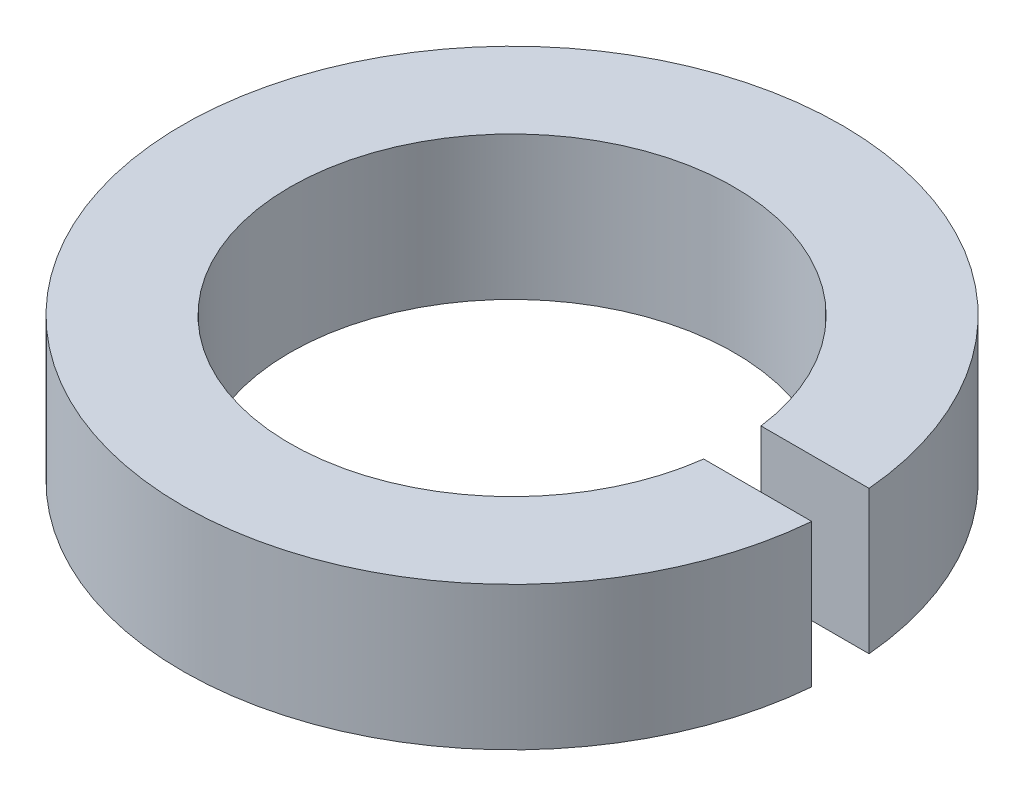
ISO-10303-21;
HEADER;
FILE_DESCRIPTION(('STEP AP214'),'2;1');
FILE_NAME('part.step','',(''),(''),'','','');
FILE_SCHEMA(('AUTOMOTIVE_DESIGN { 1 0 10303 214 1 1 1 1 }'));
ENDSEC;
DATA;
#1=APPLICATION_CONTEXT('core data for automotive mechanical design processes');
#2=APPLICATION_PROTOCOL_DEFINITION('international standard','automotive_design',2000,#1);
#3=PRODUCT_CONTEXT('',#1,'mechanical');
#4=PRODUCT('Part','Part','',(#3));
#5=PRODUCT_RELATED_PRODUCT_CATEGORY('part','',(#4));
#6=PRODUCT_DEFINITION_FORMATION('','',#4);
#7=PRODUCT_DEFINITION_CONTEXT('part definition',#1,'design');
#8=PRODUCT_DEFINITION('design','',#6,#7);
#9=PRODUCT_DEFINITION_SHAPE('','',#8);
#10=(LENGTH_UNIT() NAMED_UNIT(*) SI_UNIT(.MILLI.,.METRE.));
#11=(NAMED_UNIT(*) PLANE_ANGLE_UNIT() SI_UNIT($,.RADIAN.));
#12=(NAMED_UNIT(*) SI_UNIT($,.STERADIAN.) SOLID_ANGLE_UNIT());
#13=UNCERTAINTY_MEASURE_WITH_UNIT(LENGTH_MEASURE(1.E-05),#10,'distance_accuracy_value','');
#14=(GEOMETRIC_REPRESENTATION_CONTEXT(3) GLOBAL_UNCERTAINTY_ASSIGNED_CONTEXT((#13)) GLOBAL_UNIT_ASSIGNED_CONTEXT((#10,
#11,#12)) REPRESENTATION_CONTEXT('',''));
#15=CARTESIAN_POINT('',(0.,0.,0.));
#16=DIRECTION('',(0.,0.,1.));
#17=DIRECTION('',(1.,0.,0.));
#18=AXIS2_PLACEMENT_3D('',#15,#16,#17);
#19=CARTESIAN_POINT('',(0.,0.,0.));
#20=DIRECTION('',(0.,1.,0.));
#21=DIRECTION('',(0.,0.,1.));
#22=AXIS2_PLACEMENT_3D('',#19,#20,#21);
#23=PLANE('',#22);
#24=DIRECTION('',(-1.,0.,0.));
#25=VECTOR('',#24,1.);
#26=CARTESIAN_POINT('',(1.,0.,-0.2));
#27=LINE('',#26,#25);
#28=CARTESIAN_POINT('',(2.29128784747792,0.,-0.2));
#29=VERTEX_POINT('',#28);
#30=CARTESIAN_POINT('',(1.53704261489394,0.,-0.2));
#31=VERTEX_POINT('',#30);
#32=EDGE_CURVE('E58',#29,#31,#27,.T.);
#33=ORIENTED_EDGE('',*,*,#32,.T.);
#34=CARTESIAN_POINT('',(0.,0.,0.));
#35=DIRECTION('',(0.,-1.,0.));
#36=DIRECTION('',(0.,0.,-1.));
#37=AXIS2_PLACEMENT_3D('',#34,#35,#36);
#38=CIRCLE('',#37,1.55);
#39=CARTESIAN_POINT('',(1.53704261489394,0.,0.2));
#40=VERTEX_POINT('',#39);
#41=EDGE_CURVE('E81',#31,#40,#38,.F.);
#42=ORIENTED_EDGE('',*,*,#41,.T.);
#43=DIRECTION('',(1.,0.,0.));
#44=VECTOR('',#43,1.);
#45=CARTESIAN_POINT('',(1.,0.,0.2));
#46=LINE('',#45,#44);
#47=CARTESIAN_POINT('',(2.29128784747792,0.,0.2));
#48=VERTEX_POINT('',#47);
#49=EDGE_CURVE('E60',#40,#48,#46,.T.);
#50=ORIENTED_EDGE('',*,*,#49,.T.);
#51=CARTESIAN_POINT('',(0.,0.,0.));
#52=DIRECTION('',(0.,-1.,0.));
#53=DIRECTION('',(0.,0.,-1.));
#54=AXIS2_PLACEMENT_3D('',#51,#52,#53);
#55=CIRCLE('',#54,2.3);
#56=EDGE_CURVE('E19',#29,#48,#55,.F.);
#57=ORIENTED_EDGE('',*,*,#56,.F.);
#58=EDGE_LOOP('',(#33,#42,#50,#57));
#59=FACE_BOUND('',#58,.T.);
#60=ADVANCED_FACE('F16',(#59),#23,.F.);
#61=CARTESIAN_POINT('',(1.,0.,-0.2));
#62=DIRECTION('',(0.,0.,-1.));
#63=DIRECTION('',(-1.,0.,0.));
#64=AXIS2_PLACEMENT_3D('',#61,#62,#63);
#65=PLANE('',#64);
#66=DIRECTION('',(0.,-1.,0.));
#67=VECTOR('',#66,1.);
#68=CARTESIAN_POINT('',(1.53704261489394,1.,-0.2));
#69=LINE('',#68,#67);
#70=CARTESIAN_POINT('',(1.53704261489394,1.,-0.2));
#71=VERTEX_POINT('',#70);
#72=EDGE_CURVE('E69',#71,#31,#69,.T.);
#73=ORIENTED_EDGE('',*,*,#72,.T.);
#74=ORIENTED_EDGE('',*,*,#32,.F.);
#75=DIRECTION('',(0.,-1.,0.));
#76=VECTOR('',#75,1.);
#77=CARTESIAN_POINT('',(2.29128784747792,1.,-0.2));
#78=LINE('',#77,#76);
#79=CARTESIAN_POINT('',(2.29128784747792,1.,-0.2));
#80=VERTEX_POINT('',#79);
#81=EDGE_CURVE('E63',#80,#29,#78,.T.);
#82=ORIENTED_EDGE('',*,*,#81,.F.);
#83=DIRECTION('',(1.,0.,0.));
#84=VECTOR('',#83,1.);
#85=CARTESIAN_POINT('',(0.,1.,-0.2));
#86=LINE('',#85,#84);
#87=EDGE_CURVE('E80',#71,#80,#86,.T.);
#88=ORIENTED_EDGE('',*,*,#87,.F.);
#89=EDGE_LOOP('',(#73,#74,#82,#88));
#90=FACE_BOUND('',#89,.T.);
#91=ADVANCED_FACE('F65',(#90),#65,.F.);
#92=CARTESIAN_POINT('',(0.,1.,0.));
#93=DIRECTION('',(0.,-1.,0.));
#94=DIRECTION('',(0.,0.,-1.));
#95=AXIS2_PLACEMENT_3D('',#92,#93,#94);
#96=CYLINDRICAL_SURFACE('',#95,2.3);
#97=ORIENTED_EDGE('',*,*,#56,.T.);
#98=DIRECTION('',(0.,1.,0.));
#99=VECTOR('',#98,1.);
#100=CARTESIAN_POINT('',(2.29128784747792,0.,0.2));
#101=LINE('',#100,#99);
#102=CARTESIAN_POINT('',(2.29128784747792,1.,0.2));
#103=VERTEX_POINT('',#102);
#104=EDGE_CURVE('E62',#48,#103,#101,.T.);
#105=ORIENTED_EDGE('',*,*,#104,.T.);
#106=CARTESIAN_POINT('',(0.,1.,0.));
#107=DIRECTION('',(0.,-1.,0.));
#108=DIRECTION('',(0.,0.,-1.));
#109=AXIS2_PLACEMENT_3D('',#106,#107,#108);
#110=CIRCLE('',#109,2.3);
#111=EDGE_CURVE('E73',#80,#103,#110,.F.);
#112=ORIENTED_EDGE('',*,*,#111,.F.);
#113=ORIENTED_EDGE('',*,*,#81,.T.);
#114=EDGE_LOOP('',(#97,#105,#112,#113));
#115=FACE_BOUND('',#114,.T.);
#116=ADVANCED_FACE('F72',(#115),#96,.T.);
#117=CARTESIAN_POINT('',(1.,0.,0.2));
#118=DIRECTION('',(0.,0.,1.));
#119=DIRECTION('',(1.,0.,0.));
#120=AXIS2_PLACEMENT_3D('',#117,#118,#119);
#121=PLANE('',#120);
#122=DIRECTION('',(0.,-1.,0.));
#123=VECTOR('',#122,1.);
#124=CARTESIAN_POINT('',(1.53704261489394,1.,0.2));
#125=LINE('',#124,#123);
#126=CARTESIAN_POINT('',(1.53704261489394,1.,0.2));
#127=VERTEX_POINT('',#126);
#128=EDGE_CURVE('E34',#40,#127,#125,.F.);
#129=ORIENTED_EDGE('',*,*,#128,.T.);
#130=DIRECTION('',(1.,0.,0.));
#131=VECTOR('',#130,1.);
#132=CARTESIAN_POINT('',(0.,1.,0.2));
#133=LINE('',#132,#131);
#134=EDGE_CURVE('E25',#103,#127,#133,.F.);
#135=ORIENTED_EDGE('',*,*,#134,.F.);
#136=ORIENTED_EDGE('',*,*,#104,.F.);
#137=ORIENTED_EDGE('',*,*,#49,.F.);
#138=EDGE_LOOP('',(#129,#135,#136,#137));
#139=FACE_BOUND('',#138,.T.);
#140=ADVANCED_FACE('F88',(#139),#121,.F.);
#141=CARTESIAN_POINT('',(0.,1.,0.));
#142=DIRECTION('',(0.,-1.,0.));
#143=DIRECTION('',(0.,0.,-1.));
#144=AXIS2_PLACEMENT_3D('',#141,#142,#143);
#145=CYLINDRICAL_SURFACE('',#144,1.55);
#146=ORIENTED_EDGE('',*,*,#72,.F.);
#147=CARTESIAN_POINT('',(0.,1.,0.));
#148=DIRECTION('',(0.,-1.,0.));
#149=DIRECTION('',(0.,0.,-1.));
#150=AXIS2_PLACEMENT_3D('',#147,#148,#149);
#151=CIRCLE('',#150,1.55);
#152=EDGE_CURVE('E11',#127,#71,#151,.T.);
#153=ORIENTED_EDGE('',*,*,#152,.F.);
#154=ORIENTED_EDGE('',*,*,#128,.F.);
#155=ORIENTED_EDGE('',*,*,#41,.F.);
#156=EDGE_LOOP('',(#146,#153,#154,#155));
#157=FACE_BOUND('',#156,.T.);
#158=ADVANCED_FACE('F90',(#157),#145,.F.);
#159=CARTESIAN_POINT('',(0.,1.,0.));
#160=DIRECTION('',(0.,1.,0.));
#161=DIRECTION('',(0.,0.,1.));
#162=AXIS2_PLACEMENT_3D('',#159,#160,#161);
#163=PLANE('',#162);
#164=ORIENTED_EDGE('',*,*,#152,.T.);
#165=ORIENTED_EDGE('',*,*,#87,.T.);
#166=ORIENTED_EDGE('',*,*,#111,.T.);
#167=ORIENTED_EDGE('',*,*,#134,.T.);
#168=EDGE_LOOP('',(#164,#165,#166,#167));
#169=FACE_BOUND('',#168,.T.);
#170=ADVANCED_FACE('F87',(#169),#163,.T.);
#171=CLOSED_SHELL('',(#60,#91,#116,#140,#158,#170));
#172=MANIFOLD_SOLID_BREP('B1',#171);
#173=ADVANCED_BREP_SHAPE_REPRESENTATION('',(#18,#172),#14);
#174=SHAPE_DEFINITION_REPRESENTATION(#9,#173);
ENDSEC;
END-ISO-10303-21;
